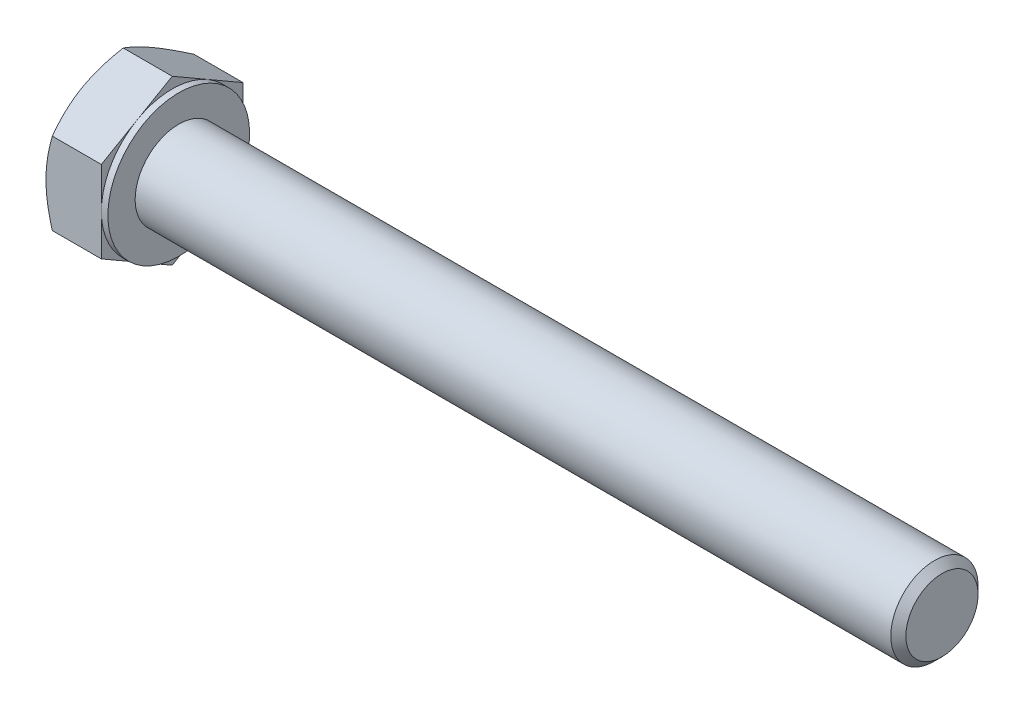
ISO-10303-21;
HEADER;
FILE_DESCRIPTION(('STEP AP214'),'2;1');
FILE_NAME('part.step','',(''),(''),'','','');
FILE_SCHEMA(('AUTOMOTIVE_DESIGN { 1 0 10303 214 1 1 1 1 }'));
ENDSEC;
DATA;
#1=APPLICATION_CONTEXT('core data for automotive mechanical design processes');
#2=APPLICATION_PROTOCOL_DEFINITION('international standard','automotive_design',2000,#1);
#3=PRODUCT_CONTEXT('',#1,'mechanical');
#4=PRODUCT('Part','Part','',(#3));
#5=PRODUCT_RELATED_PRODUCT_CATEGORY('part','',(#4));
#6=PRODUCT_DEFINITION_FORMATION('','',#4);
#7=PRODUCT_DEFINITION_CONTEXT('part definition',#1,'design');
#8=PRODUCT_DEFINITION('design','',#6,#7);
#9=PRODUCT_DEFINITION_SHAPE('','',#8);
#10=(LENGTH_UNIT() NAMED_UNIT(*) SI_UNIT(.MILLI.,.METRE.));
#11=(NAMED_UNIT(*) PLANE_ANGLE_UNIT() SI_UNIT($,.RADIAN.));
#12=(NAMED_UNIT(*) SI_UNIT($,.STERADIAN.) SOLID_ANGLE_UNIT());
#13=UNCERTAINTY_MEASURE_WITH_UNIT(LENGTH_MEASURE(1.E-05),#10,'distance_accuracy_value','');
#14=(GEOMETRIC_REPRESENTATION_CONTEXT(3) GLOBAL_UNCERTAINTY_ASSIGNED_CONTEXT((#13)) GLOBAL_UNIT_ASSIGNED_CONTEXT((#10,
#11,#12)) REPRESENTATION_CONTEXT('',''));
#15=CARTESIAN_POINT('',(0.,0.,0.));
#16=DIRECTION('',(0.,0.,1.));
#17=DIRECTION('',(1.,0.,0.));
#18=AXIS2_PLACEMENT_3D('',#15,#16,#17);
#19=CARTESIAN_POINT('',(5.675,7.50555349946514,0.));
#20=DIRECTION('',(1.,0.,0.));
#21=DIRECTION('',(0.,0.,-1.));
#22=AXIS2_PLACEMENT_3D('',#19,#20,#21);
#23=PLANE('',#22);
#24=CARTESIAN_POINT('',(5.675,0.,0.));
#25=DIRECTION('',(1.,0.,0.));
#26=DIRECTION('',(0.,0.,-1.));
#27=AXIS2_PLACEMENT_3D('',#24,#25,#26);
#28=CIRCLE('',#27,4.);
#29=CARTESIAN_POINT('',(5.675,0.,-4.));
#30=VERTEX_POINT('',#29);
#31=EDGE_CURVE('E279',#30,#30,#28,.F.);
#32=ORIENTED_EDGE('',*,*,#31,.T.);
#33=EDGE_LOOP('',(#32));
#34=FACE_BOUND('',#33,.T.);
#35=CARTESIAN_POINT('',(5.675,0.,0.));
#36=DIRECTION('',(1.,0.,0.));
#37=DIRECTION('',(0.,0.,-1.));
#38=AXIS2_PLACEMENT_3D('',#35,#36,#37);
#39=CIRCLE('',#38,6.5);
#40=CARTESIAN_POINT('',(5.675,0.,-6.5));
#41=VERTEX_POINT('',#40);
#42=EDGE_CURVE('E298',#41,#41,#39,.T.);
#43=ORIENTED_EDGE('',*,*,#42,.T.);
#44=EDGE_LOOP('',(#43));
#45=FACE_BOUND('',#44,.T.);
#46=ADVANCED_FACE('F35',(#34,#45),#23,.T.);
#47=CARTESIAN_POINT('',(0.,0.,0.));
#48=DIRECTION('',(-1.,0.,0.));
#49=DIRECTION('',(0.,0.,1.));
#50=AXIS2_PLACEMENT_3D('',#47,#48,#49);
#51=CYLINDRICAL_SURFACE('',#50,4.);
#52=ORIENTED_EDGE('',*,*,#31,.F.);
#53=EDGE_LOOP('',(#52));
#54=FACE_BOUND('',#53,.T.);
#55=CARTESIAN_POINT('',(74.9845,0.,0.));
#56=DIRECTION('',(-1.,0.,0.));
#57=DIRECTION('',(0.,0.,1.));
#58=AXIS2_PLACEMENT_3D('',#55,#56,#57);
#59=CIRCLE('',#58,4.);
#60=CARTESIAN_POINT('',(74.9845,0.,4.));
#61=VERTEX_POINT('',#60);
#62=EDGE_CURVE('E276',#61,#61,#59,.T.);
#63=ORIENTED_EDGE('',*,*,#62,.T.);
#64=EDGE_LOOP('',(#63));
#65=FACE_BOUND('',#64,.T.);
#66=ADVANCED_FACE('F250',(#54,#65),#51,.T.);
#67=CARTESIAN_POINT('',(75.675,0.,0.));
#68=DIRECTION('',(-1.,0.,0.));
#69=DIRECTION('',(0.,0.,1.));
#70=AXIS2_PLACEMENT_3D('',#67,#68,#69);
#71=CONICAL_SURFACE('',#70,3.3095,0.785398163397411);
#72=ORIENTED_EDGE('',*,*,#62,.F.);
#73=EDGE_LOOP('',(#72));
#74=FACE_BOUND('',#73,.T.);
#75=CARTESIAN_POINT('',(75.675,0.,0.));
#76=DIRECTION('',(-1.,0.,0.));
#77=DIRECTION('',(0.,0.,1.));
#78=AXIS2_PLACEMENT_3D('',#75,#76,#77);
#79=CIRCLE('',#78,3.3095);
#80=CARTESIAN_POINT('',(75.675,0.,3.3095));
#81=VERTEX_POINT('',#80);
#82=EDGE_CURVE('E274',#81,#81,#79,.T.);
#83=ORIENTED_EDGE('',*,*,#82,.T.);
#84=EDGE_LOOP('',(#83));
#85=FACE_BOUND('',#84,.T.);
#86=ADVANCED_FACE('F255',(#74,#85),#71,.T.);
#87=CARTESIAN_POINT('',(75.675,0.,0.));
#88=DIRECTION('',(-1.,0.,0.));
#89=DIRECTION('',(0.,0.,1.));
#90=AXIS2_PLACEMENT_3D('',#87,#88,#89);
#91=PLANE('',#90);
#92=ORIENTED_EDGE('',*,*,#82,.F.);
#93=EDGE_LOOP('',(#92));
#94=FACE_BOUND('',#93,.T.);
#95=ADVANCED_FACE('F262',(#94),#91,.F.);
#96=CARTESIAN_POINT('',(5.075,6.5,0.));
#97=DIRECTION('',(1.,0.,0.));
#98=DIRECTION('',(0.,0.,-1.));
#99=AXIS2_PLACEMENT_3D('',#96,#97,#98);
#100=PLANE('',#99);
#101=DIRECTION('',(0.,0.500000000000001,0.866025403784438));
#102=VECTOR('',#101,1.);
#103=CARTESIAN_POINT('',(5.075,3.75277674973256,-6.5));
#104=LINE('',#103,#102);
#105=CARTESIAN_POINT('',(5.075,3.75277674973256,-6.5));
#106=VERTEX_POINT('',#105);
#107=CARTESIAN_POINT('',(5.075,5.62916512459885,-3.25000000000001));
#108=VERTEX_POINT('',#107);
#109=EDGE_CURVE('E168',#106,#108,#104,.T.);
#110=ORIENTED_EDGE('',*,*,#109,.T.);
#111=CARTESIAN_POINT('',(5.075,0.,0.));
#112=DIRECTION('',(-1.,0.,0.));
#113=DIRECTION('',(0.,0.,1.));
#114=AXIS2_PLACEMENT_3D('',#111,#112,#113);
#115=CIRCLE('',#114,6.5);
#116=CARTESIAN_POINT('',(5.075,0.,-6.5));
#117=VERTEX_POINT('',#116);
#118=EDGE_CURVE('E51',#108,#117,#115,.T.);
#119=ORIENTED_EDGE('',*,*,#118,.T.);
#120=DIRECTION('',(0.,1.,0.));
#121=VECTOR('',#120,1.);
#122=CARTESIAN_POINT('',(5.075,3.75277674973256,-6.5));
#123=LINE('',#122,#121);
#124=EDGE_CURVE('E40',#117,#106,#123,.T.);
#125=ORIENTED_EDGE('',*,*,#124,.T.);
#126=EDGE_LOOP('',(#110,#119,#125));
#127=FACE_BOUND('',#126,.T.);
#128=ADVANCED_FACE('F265',(#127),#100,.T.);
#129=CARTESIAN_POINT('',(5.075,7.50555349946514,0.));
#130=VERTEX_POINT('',#129);
#131=EDGE_CURVE('E166',#108,#130,#104,.T.);
#132=ORIENTED_EDGE('',*,*,#131,.T.);
#133=DIRECTION('',(0.,-0.500000000000001,0.866025403784438));
#134=VECTOR('',#133,1.);
#135=CARTESIAN_POINT('',(5.075,7.50555349946514,0.));
#136=LINE('',#135,#134);
#137=CARTESIAN_POINT('',(5.075,5.62916512459885,3.25000000000001));
#138=VERTEX_POINT('',#137);
#139=EDGE_CURVE('E165',#130,#138,#136,.T.);
#140=ORIENTED_EDGE('',*,*,#139,.T.);
#141=EDGE_CURVE('E154',#138,#108,#115,.T.);
#142=ORIENTED_EDGE('',*,*,#141,.T.);
#143=EDGE_LOOP('',(#132,#140,#142));
#144=FACE_BOUND('',#143,.T.);
#145=ADVANCED_FACE('F270',(#144),#100,.T.);
#146=CARTESIAN_POINT('',(5.075,3.75277674973256,6.5));
#147=VERTEX_POINT('',#146);
#148=EDGE_CURVE('E133',#138,#147,#136,.T.);
#149=ORIENTED_EDGE('',*,*,#148,.T.);
#150=DIRECTION('',(0.,-1.,0.));
#151=VECTOR('',#150,1.);
#152=CARTESIAN_POINT('',(5.075,3.75277674973256,6.5));
#153=LINE('',#152,#151);
#154=CARTESIAN_POINT('',(5.075,0.,6.5));
#155=VERTEX_POINT('',#154);
#156=EDGE_CURVE('E127',#147,#155,#153,.T.);
#157=ORIENTED_EDGE('',*,*,#156,.T.);
#158=EDGE_CURVE('E131',#155,#138,#115,.T.);
#159=ORIENTED_EDGE('',*,*,#158,.T.);
#160=EDGE_LOOP('',(#149,#157,#159));
#161=FACE_BOUND('',#160,.T.);
#162=ADVANCED_FACE('F129',(#161),#100,.T.);
#163=CARTESIAN_POINT('',(5.075,-3.75277674973257,6.5));
#164=VERTEX_POINT('',#163);
#165=EDGE_CURVE('E137',#155,#164,#153,.T.);
#166=ORIENTED_EDGE('',*,*,#165,.T.);
#167=DIRECTION('',(0.,-0.500000000000001,-0.866025403784438));
#168=VECTOR('',#167,1.);
#169=CARTESIAN_POINT('',(5.075,-7.50555349946515,0.));
#170=LINE('',#169,#168);
#171=CARTESIAN_POINT('',(5.075,-5.62916512459885,3.25000000000001));
#172=VERTEX_POINT('',#171);
#173=EDGE_CURVE('E144',#164,#172,#170,.T.);
#174=ORIENTED_EDGE('',*,*,#173,.T.);
#175=EDGE_CURVE('E141',#172,#155,#115,.T.);
#176=ORIENTED_EDGE('',*,*,#175,.T.);
#177=EDGE_LOOP('',(#166,#174,#176));
#178=FACE_BOUND('',#177,.T.);
#179=ADVANCED_FACE('F142',(#178),#100,.T.);
#180=CARTESIAN_POINT('',(5.075,-7.50555349946515,0.));
#181=VERTEX_POINT('',#180);
#182=EDGE_CURVE('E160',#172,#181,#170,.T.);
#183=ORIENTED_EDGE('',*,*,#182,.T.);
#184=DIRECTION('',(0.,0.500000000000001,-0.866025403784438));
#185=VECTOR('',#184,1.);
#186=CARTESIAN_POINT('',(5.075,-3.75277674973258,-6.5));
#187=LINE('',#186,#185);
#188=CARTESIAN_POINT('',(5.075,-5.62916512459885,-3.25000000000001));
#189=VERTEX_POINT('',#188);
#190=EDGE_CURVE('E334',#181,#189,#187,.T.);
#191=ORIENTED_EDGE('',*,*,#190,.T.);
#192=EDGE_CURVE('E148',#189,#172,#115,.T.);
#193=ORIENTED_EDGE('',*,*,#192,.T.);
#194=EDGE_LOOP('',(#183,#191,#193));
#195=FACE_BOUND('',#194,.T.);
#196=ADVANCED_FACE('F339',(#195),#100,.T.);
#197=CARTESIAN_POINT('',(5.075,-3.75277674973258,-6.5));
#198=VERTEX_POINT('',#197);
#199=EDGE_CURVE('E155',#189,#198,#187,.T.);
#200=ORIENTED_EDGE('',*,*,#199,.T.);
#201=EDGE_CURVE('E11',#198,#117,#123,.T.);
#202=ORIENTED_EDGE('',*,*,#201,.T.);
#203=EDGE_CURVE('E352',#117,#189,#115,.T.);
#204=ORIENTED_EDGE('',*,*,#203,.T.);
#205=EDGE_LOOP('',(#200,#202,#204));
#206=FACE_BOUND('',#205,.T.);
#207=ADVANCED_FACE('F271',(#206),#100,.T.);
#208=CARTESIAN_POINT('',(0.,0.,0.));
#209=DIRECTION('',(-1.,0.,0.));
#210=DIRECTION('',(0.,0.,1.));
#211=AXIS2_PLACEMENT_3D('',#208,#209,#210);
#212=CYLINDRICAL_SURFACE('',#211,6.5);
#213=ORIENTED_EDGE('',*,*,#118,.F.);
#214=ORIENTED_EDGE('',*,*,#141,.F.);
#215=ORIENTED_EDGE('',*,*,#158,.F.);
#216=ORIENTED_EDGE('',*,*,#175,.F.);
#217=ORIENTED_EDGE('',*,*,#192,.F.);
#218=ORIENTED_EDGE('',*,*,#203,.F.);
#219=EDGE_LOOP('',(#213,#214,#215,#216,#217,#218));
#220=FACE_BOUND('',#219,.T.);
#221=ORIENTED_EDGE('',*,*,#42,.F.);
#222=EDGE_LOOP('',(#221));
#223=FACE_BOUND('',#222,.T.);
#224=ADVANCED_FACE('F151',(#220,#223),#212,.T.);
#225=CARTESIAN_POINT('',(0.,7.50555349946514,0.));
#226=DIRECTION('',(1.,0.,0.));
#227=DIRECTION('',(0.,0.,-1.));
#228=AXIS2_PLACEMENT_3D('',#225,#226,#227);
#229=PLANE('',#228);
#230=CARTESIAN_POINT('',(0.,0.,0.));
#231=DIRECTION('',(1.,0.,0.));
#232=DIRECTION('',(0.,0.,-1.));
#233=AXIS2_PLACEMENT_3D('',#230,#231,#232);
#234=CIRCLE('',#233,6.5);
#235=CARTESIAN_POINT('',(0.,0.,-6.5));
#236=VERTEX_POINT('',#235);
#237=CARTESIAN_POINT('',(0.,5.62916512459885,-3.25000000000001));
#238=VERTEX_POINT('',#237);
#239=EDGE_CURVE('E297',#236,#238,#234,.T.);
#240=ORIENTED_EDGE('',*,*,#239,.F.);
#241=CARTESIAN_POINT('',(0.,-5.62916512459885,-3.25000000000001));
#242=VERTEX_POINT('',#241);
#243=EDGE_CURVE('E294',#242,#236,#234,.T.);
#244=ORIENTED_EDGE('',*,*,#243,.F.);
#245=CARTESIAN_POINT('',(0.,-5.62916512459885,3.25000000000001));
#246=VERTEX_POINT('',#245);
#247=EDGE_CURVE('E296',#246,#242,#234,.T.);
#248=ORIENTED_EDGE('',*,*,#247,.F.);
#249=CARTESIAN_POINT('',(0.,0.,6.5));
#250=VERTEX_POINT('',#249);
#251=EDGE_CURVE('E306',#250,#246,#234,.T.);
#252=ORIENTED_EDGE('',*,*,#251,.F.);
#253=CARTESIAN_POINT('',(0.,0.,0.));
#254=DIRECTION('',(-1.,0.,0.));
#255=DIRECTION('',(0.,0.,1.));
#256=AXIS2_PLACEMENT_3D('',#253,#254,#255);
#257=CIRCLE('',#256,6.5);
#258=CARTESIAN_POINT('',(0.,5.62916512459885,3.25000000000001));
#259=VERTEX_POINT('',#258);
#260=EDGE_CURVE('E169',#250,#259,#257,.T.);
#261=ORIENTED_EDGE('',*,*,#260,.T.);
#262=EDGE_CURVE('E301',#238,#259,#234,.T.);
#263=ORIENTED_EDGE('',*,*,#262,.F.);
#264=EDGE_LOOP('',(#240,#244,#248,#252,#261,#263));
#265=FACE_BOUND('',#264,.T.);
#266=ADVANCED_FACE('F200',(#265),#229,.F.);
#267=CARTESIAN_POINT('',(0.,0.,0.));
#268=DIRECTION('',(1.,0.,0.));
#269=DIRECTION('',(0.,0.,-1.));
#270=AXIS2_PLACEMENT_3D('',#267,#268,#269);
#271=CONICAL_SURFACE('',#270,6.5,1.0471975511966);
#272=CARTESIAN_POINT('',(0.580623251805865,3.75266127967873,6.5002));
#273=CARTESIAN_POINT('',(0.533004423075483,3.8351516191275,6.35732254094112));
#274=CARTESIAN_POINT('',(0.487546700602704,3.91794952254312,6.21391236546509));
#275=CARTESIAN_POINT('',(0.401548682023044,4.08421773795794,5.9259273686828));
#276=CARTESIAN_POINT('',(0.361010507228023,4.16768832359105,5.78135207342873));
#277=CARTESIAN_POINT('',(0.247571001123207,4.41943655294051,5.34531134947996));
#278=CARTESIAN_POINT('',(0.183047807128738,4.58870793403689,5.05212471715368));
#279=CARTESIAN_POINT('',(0.107386583547491,4.84201947708215,4.61337625445563));
#280=CARTESIAN_POINT('',(0.0858328564569869,4.92530276780316,4.46912536350531));
#281=CARTESIAN_POINT('',(0.0496903146061184,5.09224566542477,4.17997178286191));
#282=CARTESIAN_POINT('',(0.0351008844596658,5.17590523841627,4.03506915190111));
#283=CARTESIAN_POINT('',(0.0132587525073462,5.34336968579964,3.74501222057168));
#284=CARTESIAN_POINT('',(0.0059977243221076,5.427174286676,3.59985839394579));
#285=CARTESIAN_POINT('',(-0.00103969741776859,5.59485627940483,3.30942466302505));
#286=CARTESIAN_POINT('',(-0.000816322187795488,5.6787336689286,3.16414476276364));
#287=CARTESIAN_POINT('',(0.010083458515165,5.90853103021317,2.76612405757351));
#288=CARTESIAN_POINT('',(0.0283818178694134,6.05437578112763,2.51351353897243));
#289=CARTESIAN_POINT('',(0.0864063414576754,6.34509659313135,2.00997032176432));
#290=CARTESIAN_POINT('',(0.126152338538245,6.48997163178545,1.75903939406692));
#291=CARTESIAN_POINT('',(0.22550590320215,6.78127752911039,1.25448277935568));
#292=CARTESIAN_POINT('',(0.285534425638028,6.92767163007068,1.00092075856409));
#293=CARTESIAN_POINT('',(0.42177499250987,7.21827667013277,0.497578064240955));
#294=CARTESIAN_POINT('',(0.497955034163595,7.36249133098589,0.247790944447036));
#295=CARTESIAN_POINT('',(0.580623251805869,7.50566896951898,-0.000200000000000203));
#296=B_SPLINE_CURVE_WITH_KNOTS('',3,(#272,#273,#274,#275,#276,#277,#278,#279,#280,#281,#282,
#283,#284,#285,#286,#287,#288,#289,#290,#291,#292,#293,#294,#295),.UNSPECIFIED.,.F.,.F.,(4,2,2,
2,2,2,2,2,2,2,2,4),(0.,0.515105052395588,1.03043143507524,2.06322554824262,2.56697389547996,
3.07067772176454,3.57380860368928,4.0769239424252,4.9527935470566,5.82947446853466,
6.72559912449736,7.61996451221046),.UNSPECIFIED.);
#297=CARTESIAN_POINT('',(0.580556583600765,7.50555349946514,0.));
#298=VERTEX_POINT('',#297);
#299=EDGE_CURVE('E219',#259,#298,#296,.T.);
#300=ORIENTED_EDGE('',*,*,#299,.T.);
#301=CARTESIAN_POINT('',(0.580623251805869,7.50566896951898,0.0002));
#302=CARTESIAN_POINT('',(0.533004423075487,7.4231786300702,-0.14267745905888));
#303=CARTESIAN_POINT('',(0.487546700602708,7.34038072665458,-0.286087634534913));
#304=CARTESIAN_POINT('',(0.401548682023047,7.17411251123976,-0.574072631317195));
#305=CARTESIAN_POINT('',(0.361010507228027,7.09064192560665,-0.718647926571264));
#306=CARTESIAN_POINT('',(0.24757100112321,6.83889369625719,-1.15468865052003));
#307=CARTESIAN_POINT('',(0.183047807128741,6.66962231516081,-1.44787528284632));
#308=CARTESIAN_POINT('',(0.107386583547493,6.41631077211555,-1.88662374554437));
#309=CARTESIAN_POINT('',(0.0858328564569883,6.33302748139454,-2.03087463649469));
#310=CARTESIAN_POINT('',(0.0496903146061195,6.16608458377293,-2.32002821713809));
#311=CARTESIAN_POINT('',(0.035100884459667,6.08242501078143,-2.46493084809889));
#312=CARTESIAN_POINT('',(0.013258752507347,5.91496056339806,-2.75498777942832));
#313=CARTESIAN_POINT('',(0.00599772432210792,5.8311559625217,-2.90014160605421));
#314=CARTESIAN_POINT('',(-0.00103969741776867,5.66347396979287,-3.19057533697495));
#315=CARTESIAN_POINT('',(-0.000816322187795479,5.5795965802691,-3.33585523723636));
#316=CARTESIAN_POINT('',(0.010083458515165,5.34979921898453,-3.73387594242649));
#317=CARTESIAN_POINT('',(0.028381817869413,5.20395446807007,-3.98648646102757));
#318=CARTESIAN_POINT('',(0.0864063414576743,4.91323365606635,-4.49002967823568));
#319=CARTESIAN_POINT('',(0.126152338538243,4.76835861741226,-4.74096060593308));
#320=CARTESIAN_POINT('',(0.225505903202148,4.47705272008731,-5.24551722064432));
#321=CARTESIAN_POINT('',(0.285534425638025,4.33065861912702,-5.49907924143591));
#322=CARTESIAN_POINT('',(0.421774992509866,4.04005357906493,-6.00242193575904));
#323=CARTESIAN_POINT('',(0.497955034163591,3.89583891821181,-6.25220905555296));
#324=CARTESIAN_POINT('',(0.580623251805865,3.75266127967873,-6.5002));
#325=B_SPLINE_CURVE_WITH_KNOTS('',3,(#301,#302,#303,#304,#305,#306,#307,#308,#309,#310,#311,
#312,#313,#314,#315,#316,#317,#318,#319,#320,#321,#322,#323,#324),.UNSPECIFIED.,.F.,.F.,(4,2,2,
2,2,2,2,2,2,2,2,4),(0.,0.515105052395588,1.03043143507525,2.06322554824262,2.56697389547997,
3.07067772176454,3.57380860368928,4.0769239424252,4.9527935470566,5.82947446853467,
6.72559912449737,7.61996451221046),.UNSPECIFIED.);
#326=EDGE_CURVE('E59',#298,#238,#325,.T.);
#327=ORIENTED_EDGE('',*,*,#326,.T.);
#328=ORIENTED_EDGE('',*,*,#262,.T.);
#329=EDGE_LOOP('',(#300,#327,#328));
#330=FACE_BOUND('',#329,.T.);
#331=ADVANCED_FACE('F348',(#330),#271,.T.);
#332=CARTESIAN_POINT('',(3.18835311590246,-10.1137456678934,6.5));
#333=CARTESIAN_POINT('',(3.05034774010468,-9.82952666322138,6.5));
#334=CARTESIAN_POINT('',(2.91365616489938,-9.54465869649274,6.5));
#335=CARTESIAN_POINT('',(2.64363899497541,-8.97327978057921,6.5));
#336=CARTESIAN_POINT('',(2.51031392459097,-8.68676858388472,6.5));
#337=CARTESIAN_POINT('',(2.24710473482719,-8.11029837842688,6.5));
#338=CARTESIAN_POINT('',(2.1172430043868,-7.82032911201511,6.5));
#339=CARTESIAN_POINT('',(1.86279082826903,-7.23809541022339,6.5));
#340=CARTESIAN_POINT('',(1.73820013554674,-6.94583108317207,6.5));
#341=CARTESIAN_POINT('',(1.49176685426961,-6.34906440963036,6.5));
#342=CARTESIAN_POINT('',(1.37014257641265,-6.04447142288872,6.5));
#343=CARTESIAN_POINT('',(1.13601865758149,-5.43173420957315,6.5));
#344=CARTESIAN_POINT('',(1.02352003558022,-5.12358959079846,6.5));
#345=CARTESIAN_POINT('',(0.810575368239917,-4.5038256978226,6.5));
#346=CARTESIAN_POINT('',(0.710105232302005,-4.19221478266993,6.5));
#347=CARTESIAN_POINT('',(0.524420166144454,-3.56452019206012,6.5));
#348=CARTESIAN_POINT('',(0.439200468206418,-3.24843794792921,6.5));
#349=CARTESIAN_POINT('',(0.288524223401197,-2.61335465712783,6.5));
#350=CARTESIAN_POINT('',(0.222961865744748,-2.29437912059505,6.5));
#351=CARTESIAN_POINT('',(0.115312883130725,-1.65238219405862,6.5));
#352=CARTESIAN_POINT('',(0.0732239014690631,-1.3293612135443,6.5));
#353=CARTESIAN_POINT('',(0.0304887136381663,-0.845231171839984,6.5));
#354=CARTESIAN_POINT('',(0.0196493434273842,-0.684982209663101,6.5));
#355=CARTESIAN_POINT('',(0.00475298486143994,-0.364162349065458,6.5));
#356=CARTESIAN_POINT('',(0.000695882908832085,-0.203591456081877,6.5));
#357=CARTESIAN_POINT('',(-0.000531597190095041,0.117577430374299,6.5));
#358=CARTESIAN_POINT('',(0.00229809017012691,0.278175424090145,6.5));
#359=CARTESIAN_POINT('',(0.0147726845547639,0.599108972823507,6.5));
#360=CARTESIAN_POINT('',(0.0244179260500518,0.759444514574219,6.5));
#361=CARTESIAN_POINT('',(0.0554961939343001,1.14369946602534,6.5));
#362=CARTESIAN_POINT('',(0.0801030490514518,1.36736763045086,6.5));
#363=CARTESIAN_POINT('',(0.141246537453378,1.81305591311688,6.5));
#364=CARTESIAN_POINT('',(0.177784759614452,2.03507580783109,6.5));
#365=CARTESIAN_POINT('',(0.303360001332116,2.69839633433796,6.5));
#366=CARTESIAN_POINT('',(0.408335815147596,3.13672010374357,6.5));
#367=CARTESIAN_POINT('',(0.590564593134941,3.79232112918118,6.5));
#368=CARTESIAN_POINT('',(0.656313198979092,4.01299150874073,6.5));
#369=CARTESIAN_POINT('',(0.794681634200732,4.45218859008391,6.5));
#370=CARTESIAN_POINT('',(0.867301513122618,4.67071527639819,6.5));
#371=CARTESIAN_POINT('',(1.01824353854295,5.10569490252726,6.5));
#372=CARTESIAN_POINT('',(1.09656388232839,5.32214847365076,6.5));
#373=CARTESIAN_POINT('',(1.25798086164821,5.75325725773039,6.5));
#374=CARTESIAN_POINT('',(1.34107741035995,5.96791250329556,6.5));
#375=CARTESIAN_POINT('',(1.56029019583041,6.51888445936372,6.5));
#376=CARTESIAN_POINT('',(1.69936356666534,6.85402316813627,6.5));
#377=CARTESIAN_POINT('',(1.98501958087353,7.52109583939393,6.5));
#378=CARTESIAN_POINT('',(2.13160288780791,7.85302951559933,6.5));
#379=CARTESIAN_POINT('',(2.43059748044951,8.51437865518658,6.5));
#380=CARTESIAN_POINT('',(2.58301057596959,8.84379329784094,6.5));
#381=CARTESIAN_POINT('',(2.89234869374927,9.50047798683784,6.5));
#382=CARTESIAN_POINT('',(3.04927357220059,9.82774810112757,6.5));
#383=CARTESIAN_POINT('',(3.36692013130636,10.4809971975748,6.5));
#384=CARTESIAN_POINT('',(3.52764676491733,10.8069737667408,6.5));
#385=CARTESIAN_POINT('',(3.85198555554899,11.4574882901034,6.5));
#386=CARTESIAN_POINT('',(4.01559773123066,11.7820262349792,6.5));
#387=CARTESIAN_POINT('',(4.50986185003774,12.7537468114441,6.5));
#388=CARTESIAN_POINT('',(4.84399997978541,13.3991555932469,6.5));
#389=CARTESIAN_POINT('',(5.4857599026592,14.6239779290894,6.5));
#390=CARTESIAN_POINT('',(5.79279643372279,15.2036995760604,6.5));
#391=CARTESIAN_POINT('',(6.4106918822763,16.3611382637875,6.5));
#392=CARTESIAN_POINT('',(6.72155099010109,16.938855202873,6.5));
#393=CARTESIAN_POINT('',(7.34519775439015,18.0910273555999,6.5));
#394=CARTESIAN_POINT('',(7.65797694168864,18.665487160613,6.5));
#395=CARTESIAN_POINT('',(8.28574397153078,19.8131486204439,6.5));
#396=CARTESIAN_POINT('',(8.60073166294279,20.3863503578957,6.5));
#397=CARTESIAN_POINT('',(8.91652967168741,20.9591024521449,6.5));
#398=B_SPLINE_CURVE_WITH_KNOTS('',3,(#332,#333,#334,#335,#336,#337,#338,#339,#340,#341,#342,
#343,#344,#345,#346,#347,#348,#349,#350,#351,#352,#353,#354,#355,#356,#357,#358,#359,#360,#361,
#362,#363,#364,#365,#366,#367,#368,#369,#370,#371,#372,#373,#374,#375,#376,#377,#378,#379,#380,
#381,#382,#383,#384,#385,#386,#387,#388,#389,#390,#391,#392,#393,#394,#395,#396,#397),
.UNSPECIFIED.,.F.,.F.,(4,2,2,2,2,2,2,2,2,2,2,2,2,2,2,2,2,2,2,2,2,2,2,2,2,2,2,2,2,2,2,2,4),(0.,
0.947868666702312,1.89588406483492,2.84900320930536,3.80207763304315,4.78589774082711,
5.76982755141752,6.75175256246685,7.73337005764394,8.70960474890991,9.68574140951124,
10.1674651053568,10.6491807326436,11.1309009419855,11.6126447932157,12.287317572382,
12.9620802330384,14.312318438093,15.0030310344276,15.6937486114326,16.3842486973571,
17.0747362352244,18.1631508683747,19.2516618378194,20.3405135142583,21.4293305231019,
22.5196540547637,23.6099846401957,25.7902468235017,27.7582608872418,29.7263733429304,
31.6886408595598,33.6507753806319),.UNSPECIFIED.);
#399=CARTESIAN_POINT('',(0.580556583600761,3.75277674973256,6.5));
#400=VERTEX_POINT('',#399);
#401=EDGE_CURVE('E233',#250,#400,#398,.T.);
#402=ORIENTED_EDGE('',*,*,#401,.T.);
#403=EDGE_CURVE('E232',#400,#259,#296,.T.);
#404=ORIENTED_EDGE('',*,*,#403,.T.);
#405=ORIENTED_EDGE('',*,*,#260,.F.);
#406=EDGE_LOOP('',(#402,#404,#405));
#407=FACE_BOUND('',#406,.T.);
#408=ADVANCED_FACE('F344',(#407),#271,.T.);
#409=CARTESIAN_POINT('',(0.580556583600764,-3.75277674973257,6.5));
#410=VERTEX_POINT('',#409);
#411=EDGE_CURVE('E277',#410,#250,#398,.T.);
#412=ORIENTED_EDGE('',*,*,#411,.T.);
#413=ORIENTED_EDGE('',*,*,#251,.T.);
#414=CARTESIAN_POINT('',(0.580623251805877,-7.50566896951899,-0.000200000000000017));
#415=CARTESIAN_POINT('',(0.533004423075495,-7.42317863007021,0.14267745905888));
#416=CARTESIAN_POINT('',(0.487546700602715,-7.34038072665459,0.286087634534913));
#417=CARTESIAN_POINT('',(0.401548682023054,-7.17411251123977,0.574072631317196));
#418=CARTESIAN_POINT('',(0.361010507228033,-7.09064192560666,0.718647926571266));
#419=CARTESIAN_POINT('',(0.247571001123216,-6.8388936962572,1.15468865052004));
#420=CARTESIAN_POINT('',(0.183047807128747,-6.66962231516082,1.44787528284632));
#421=CARTESIAN_POINT('',(0.107386583547498,-6.41631077211556,1.88662374554438));
#422=CARTESIAN_POINT('',(0.085832856456994,-6.33302748139455,2.03087463649469));
#423=CARTESIAN_POINT('',(0.0496903146061256,-6.16608458377294,2.32002821713809));
#424=CARTESIAN_POINT('',(0.0351008844596734,-6.08242501078144,2.46493084809889));
#425=CARTESIAN_POINT('',(0.0132587525073533,-5.91496056339808,2.75498777942832));
#426=CARTESIAN_POINT('',(0.0059977243221138,-5.83115596252171,2.90014160605421));
#427=CARTESIAN_POINT('',(-0.00103969741776302,-5.66347396979288,3.19057533697495));
#428=CARTESIAN_POINT('',(-0.000816322187789635,-5.57959658026911,3.33585523723636));
#429=CARTESIAN_POINT('',(0.0100834585151709,-5.34979921898454,3.7338759424265));
#430=CARTESIAN_POINT('',(0.0283818178694184,-5.20395446807008,3.98648646102757));
#431=CARTESIAN_POINT('',(0.0864063414576794,-4.91323365606636,4.49002967823568));
#432=CARTESIAN_POINT('',(0.126152338538249,-4.76835861741226,4.74096060593309));
#433=CARTESIAN_POINT('',(0.225505903202153,-4.47705272008732,5.24551722064432));
#434=CARTESIAN_POINT('',(0.285534425638029,-4.33065861912703,5.49907924143592));
#435=CARTESIAN_POINT('',(0.42177499250987,-4.04005357906494,6.00242193575905));
#436=CARTESIAN_POINT('',(0.497955034163595,-3.89583891821182,6.25220905555296));
#437=CARTESIAN_POINT('',(0.580623251805868,-3.75266127967874,6.5002));
#438=B_SPLINE_CURVE_WITH_KNOTS('',3,(#414,#415,#416,#417,#418,#419,#420,#421,#422,#423,#424,
#425,#426,#427,#428,#429,#430,#431,#432,#433,#434,#435,#436,#437),.UNSPECIFIED.,.F.,.F.,(4,2,2,
2,2,2,2,2,2,2,2,4),(0.,0.515105052395589,1.03043143507525,2.06322554824263,2.56697389547997,
3.07067772176454,3.57380860368929,4.07692394242521,4.95279354705661,5.82947446853467,
6.72559912449737,7.61996451221046),.UNSPECIFIED.);
#439=EDGE_CURVE('E221',#246,#410,#438,.T.);
#440=ORIENTED_EDGE('',*,*,#439,.T.);
#441=EDGE_LOOP('',(#412,#413,#440));
#442=FACE_BOUND('',#441,.T.);
#443=ADVANCED_FACE('F189',(#442),#271,.T.);
#444=CARTESIAN_POINT('',(0.580556583600772,-7.50555349946515,0.));
#445=VERTEX_POINT('',#444);
#446=EDGE_CURVE('E213',#445,#246,#438,.T.);
#447=ORIENTED_EDGE('',*,*,#446,.T.);
#448=ORIENTED_EDGE('',*,*,#247,.T.);
#449=CARTESIAN_POINT('',(0.580623251805869,-3.75266127967874,-6.5002));
#450=CARTESIAN_POINT('',(0.533004423075488,-3.83515161912751,-6.35732254094112));
#451=CARTESIAN_POINT('',(0.487546700602708,-3.91794952254313,-6.21391236546509));
#452=CARTESIAN_POINT('',(0.401548682023048,-4.08421773795796,-5.9259273686828));
#453=CARTESIAN_POINT('',(0.361010507228027,-4.16768832359106,-5.78135207342874));
#454=CARTESIAN_POINT('',(0.247571001123211,-4.41943655294052,-5.34531134947997));
#455=CARTESIAN_POINT('',(0.183047807128742,-4.58870793403691,-5.05212471715368));
#456=CARTESIAN_POINT('',(0.107386583547495,-4.84201947708216,-4.61337625445563));
#457=CARTESIAN_POINT('',(0.0858328564569915,-4.92530276780317,-4.46912536350531));
#458=CARTESIAN_POINT('',(0.0496903146061235,-5.09224566542478,-4.17997178286191));
#459=CARTESIAN_POINT('',(0.0351008844596713,-5.17590523841629,-4.03506915190111));
#460=CARTESIAN_POINT('',(0.0132587525073522,-5.34336968579965,-3.74501222057168));
#461=CARTESIAN_POINT('',(0.00599772432211361,-5.42717428667601,-3.59985839394579));
#462=CARTESIAN_POINT('',(-0.00103969741776234,-5.59485627940485,-3.30942466302505));
#463=CARTESIAN_POINT('',(-0.000816322187789011,-5.67873366892861,-3.16414476276364));
#464=CARTESIAN_POINT('',(0.0100834585151719,-5.90853103021318,-2.76612405757351));
#465=CARTESIAN_POINT('',(0.0283818178694203,-6.05437578112765,-2.51351353897243));
#466=CARTESIAN_POINT('',(0.0864063414576825,-6.34509659313136,-2.00997032176432));
#467=CARTESIAN_POINT('',(0.126152338538252,-6.48997163178546,-1.75903939406692));
#468=CARTESIAN_POINT('',(0.225505903202157,-6.7812775291104,-1.25448277935568));
#469=CARTESIAN_POINT('',(0.285534425638035,-6.92767163007069,-1.00092075856409));
#470=CARTESIAN_POINT('',(0.421774992509877,-7.21827667013278,-0.497578064240955));
#471=CARTESIAN_POINT('',(0.497955034163601,-7.3624913309859,-0.247790944447036));
#472=CARTESIAN_POINT('',(0.580623251805876,-7.50566896951899,0.000199999999999574));
#473=B_SPLINE_CURVE_WITH_KNOTS('',3,(#449,#450,#451,#452,#453,#454,#455,#456,#457,#458,#459,
#460,#461,#462,#463,#464,#465,#466,#467,#468,#469,#470,#471,#472),.UNSPECIFIED.,.F.,.F.,(4,2,2,
2,2,2,2,2,2,2,2,4),(0.,0.515105052395589,1.03043143507525,2.06322554824262,2.56697389547996,
3.07067772176454,3.57380860368928,4.0769239424252,4.9527935470566,5.82947446853467,
6.72559912449737,7.61996451221046),.UNSPECIFIED.);
#474=EDGE_CURVE('E220',#242,#445,#473,.T.);
#475=ORIENTED_EDGE('',*,*,#474,.T.);
#476=EDGE_LOOP('',(#447,#448,#475));
#477=FACE_BOUND('',#476,.T.);
#478=ADVANCED_FACE('F315',(#477),#271,.T.);
#479=CARTESIAN_POINT('',(0.580556583600761,3.75277674973256,-6.5));
#480=VERTEX_POINT('',#479);
#481=EDGE_CURVE('E222',#238,#480,#325,.T.);
#482=ORIENTED_EDGE('',*,*,#481,.T.);
#483=CARTESIAN_POINT('',(3.18835311590246,-10.1137456678934,-6.5));
#484=CARTESIAN_POINT('',(3.05034774010468,-9.82952666322138,-6.5));
#485=CARTESIAN_POINT('',(2.91365616489938,-9.54465869649274,-6.5));
#486=CARTESIAN_POINT('',(2.64363899497541,-8.97327978057922,-6.5));
#487=CARTESIAN_POINT('',(2.51031392459097,-8.68676858388472,-6.5));
#488=CARTESIAN_POINT('',(2.24710473482719,-8.11029837842689,-6.5));
#489=CARTESIAN_POINT('',(2.1172430043868,-7.82032911201512,-6.5));
#490=CARTESIAN_POINT('',(1.86279082826903,-7.2380954102234,-6.5));
#491=CARTESIAN_POINT('',(1.73820013554674,-6.94583108317207,-6.5));
#492=CARTESIAN_POINT('',(1.49176685426961,-6.34906440963036,-6.5));
#493=CARTESIAN_POINT('',(1.37014257641265,-6.04447142288872,-6.5));
#494=CARTESIAN_POINT('',(1.13601865758149,-5.43173420957316,-6.5));
#495=CARTESIAN_POINT('',(1.02352003558022,-5.12358959079846,-6.5));
#496=CARTESIAN_POINT('',(0.810575368239917,-4.5038256978226,-6.5));
#497=CARTESIAN_POINT('',(0.710105232302005,-4.19221478266993,-6.5));
#498=CARTESIAN_POINT('',(0.524420166144454,-3.56452019206012,-6.5));
#499=CARTESIAN_POINT('',(0.439200468206418,-3.24843794792921,-6.5));
#500=CARTESIAN_POINT('',(0.288524223401198,-2.61335465712783,-6.5));
#501=CARTESIAN_POINT('',(0.222961865744749,-2.29437912059505,-6.5));
#502=CARTESIAN_POINT('',(0.115312883130725,-1.65238219405863,-6.5));
#503=CARTESIAN_POINT('',(0.0732239014690639,-1.3293612135443,-6.5));
#504=CARTESIAN_POINT('',(0.0304887136381667,-0.845231171839985,-6.5));
#505=CARTESIAN_POINT('',(0.0196493434273843,-0.684982209663103,-6.5));
#506=CARTESIAN_POINT('',(0.00475298486143982,-0.36416234906546,-6.5));
#507=CARTESIAN_POINT('',(0.000695882908832049,-0.203591456081879,-6.5));
#508=CARTESIAN_POINT('',(-0.000531597190095004,0.117577430374298,-6.5));
#509=CARTESIAN_POINT('',(0.00229809017012692,0.278175424090144,-6.5));
#510=CARTESIAN_POINT('',(0.0147726845547639,0.599108972823506,-6.5));
#511=CARTESIAN_POINT('',(0.0244179260500518,0.759444514574218,-6.5));
#512=CARTESIAN_POINT('',(0.0554961939343001,1.14369946602534,-6.5));
#513=CARTESIAN_POINT('',(0.0801030490514518,1.36736763045086,-6.5));
#514=CARTESIAN_POINT('',(0.141246537453378,1.81305591311688,-6.5));
#515=CARTESIAN_POINT('',(0.177784759614452,2.03507580783108,-6.5));
#516=CARTESIAN_POINT('',(0.303360001332115,2.69839633433796,-6.5));
#517=CARTESIAN_POINT('',(0.408335815147595,3.13672010374357,-6.5));
#518=CARTESIAN_POINT('',(0.590564593134941,3.79232112918118,-6.5));
#519=CARTESIAN_POINT('',(0.656313198979091,4.01299150874073,-6.5));
#520=CARTESIAN_POINT('',(0.794681634200732,4.45218859008391,-6.5));
#521=CARTESIAN_POINT('',(0.867301513122617,4.67071527639819,-6.5));
#522=CARTESIAN_POINT('',(1.01824353854295,5.10569490252726,-6.5));
#523=CARTESIAN_POINT('',(1.09656388232839,5.32214847365076,-6.5));
#524=CARTESIAN_POINT('',(1.25798086164821,5.75325725773039,-6.5));
#525=CARTESIAN_POINT('',(1.34107741035995,5.96791250329556,-6.5));
#526=CARTESIAN_POINT('',(1.56029019583041,6.51888445936372,-6.5));
#527=CARTESIAN_POINT('',(1.69936356666534,6.85402316813627,-6.5));
#528=CARTESIAN_POINT('',(1.98501958087353,7.52109583939393,-6.5));
#529=CARTESIAN_POINT('',(2.13160288780791,7.85302951559933,-6.5));
#530=CARTESIAN_POINT('',(2.43059748044951,8.51437865518658,-6.5));
#531=CARTESIAN_POINT('',(2.58301057596959,8.84379329784094,-6.5));
#532=CARTESIAN_POINT('',(2.89234869374927,9.50047798683784,-6.5));
#533=CARTESIAN_POINT('',(3.04927357220059,9.82774810112757,-6.5));
#534=CARTESIAN_POINT('',(3.36692013130636,10.4809971975748,-6.5));
#535=CARTESIAN_POINT('',(3.52764676491733,10.8069737667408,-6.5));
#536=CARTESIAN_POINT('',(3.85198555554899,11.4574882901034,-6.5));
#537=CARTESIAN_POINT('',(4.01559773123066,11.7820262349792,-6.5));
#538=CARTESIAN_POINT('',(4.50986185003773,12.7537468114441,-6.5));
#539=CARTESIAN_POINT('',(4.84399997978541,13.3991555932469,-6.5));
#540=CARTESIAN_POINT('',(5.48575990265919,14.6239779290894,-6.5));
#541=CARTESIAN_POINT('',(5.79279643372279,15.2036995760604,-6.5));
#542=CARTESIAN_POINT('',(6.4106918822763,16.3611382637875,-6.5));
#543=CARTESIAN_POINT('',(6.72155099010109,16.938855202873,-6.5));
#544=CARTESIAN_POINT('',(7.34519775439015,18.0910273555999,-6.5));
#545=CARTESIAN_POINT('',(7.65797694168864,18.665487160613,-6.5));
#546=CARTESIAN_POINT('',(8.28574397153079,19.8131486204439,-6.5));
#547=CARTESIAN_POINT('',(8.60073166294279,20.3863503578957,-6.5));
#548=CARTESIAN_POINT('',(8.91652967168742,20.9591024521449,-6.5));
#549=B_SPLINE_CURVE_WITH_KNOTS('',3,(#483,#484,#485,#486,#487,#488,#489,#490,#491,#492,#493,
#494,#495,#496,#497,#498,#499,#500,#501,#502,#503,#504,#505,#506,#507,#508,#509,#510,#511,#512,
#513,#514,#515,#516,#517,#518,#519,#520,#521,#522,#523,#524,#525,#526,#527,#528,#529,#530,#531,
#532,#533,#534,#535,#536,#537,#538,#539,#540,#541,#542,#543,#544,#545,#546,#547,#548),
.UNSPECIFIED.,.F.,.F.,(4,2,2,2,2,2,2,2,2,2,2,2,2,2,2,2,2,2,2,2,2,2,2,2,2,2,2,2,2,2,2,2,4),(0.,
0.947868666702312,1.89588406483492,2.84900320930536,3.80207763304314,4.7858977408271,
5.76982755141752,6.75175256246685,7.73337005764394,8.70960474890991,9.68574140951124,
10.1674651053568,10.6491807326436,11.1309009419855,11.6126447932157,12.287317572382,
12.9620802330384,14.312318438093,15.0030310344276,15.6937486114326,16.3842486973571,
17.0747362352244,18.1631508683747,19.2516618378194,20.3405135142583,21.4293305231019,
22.5196540547637,23.6099846401957,25.7902468235016,27.7582608872418,29.7263733429304,
31.6886408595598,33.6507753806319),.UNSPECIFIED.);
#550=EDGE_CURVE('E181',#480,#236,#549,.F.);
#551=ORIENTED_EDGE('',*,*,#550,.T.);
#552=ORIENTED_EDGE('',*,*,#239,.T.);
#553=EDGE_LOOP('',(#482,#551,#552));
#554=FACE_BOUND('',#553,.T.);
#555=ADVANCED_FACE('F329',(#554),#271,.T.);
#556=CARTESIAN_POINT('',(0.580556583600765,-3.75277674973258,-6.5));
#557=VERTEX_POINT('',#556);
#558=EDGE_CURVE('E182',#557,#242,#473,.T.);
#559=ORIENTED_EDGE('',*,*,#558,.T.);
#560=ORIENTED_EDGE('',*,*,#243,.T.);
#561=EDGE_CURVE('E172',#236,#557,#549,.F.);
#562=ORIENTED_EDGE('',*,*,#561,.T.);
#563=EDGE_LOOP('',(#559,#560,#562));
#564=FACE_BOUND('',#563,.T.);
#565=ADVANCED_FACE('F198',(#564),#271,.T.);
#566=CARTESIAN_POINT('',(5.675,3.75277674973256,-6.5));
#567=DIRECTION('',(0.,0.,1.));
#568=DIRECTION('',(0.,-1.,0.));
#569=AXIS2_PLACEMENT_3D('',#566,#567,#568);
#570=PLANE('',#569);
#571=ORIENTED_EDGE('',*,*,#201,.F.);
#572=DIRECTION('',(-1.,0.,0.));
#573=VECTOR('',#572,1.);
#574=CARTESIAN_POINT('',(5.675,-3.75277674973258,-6.5));
#575=LINE('',#574,#573);
#576=EDGE_CURVE('E285',#198,#557,#575,.T.);
#577=ORIENTED_EDGE('',*,*,#576,.T.);
#578=ORIENTED_EDGE('',*,*,#561,.F.);
#579=ORIENTED_EDGE('',*,*,#550,.F.);
#580=DIRECTION('',(-1.,0.,0.));
#581=VECTOR('',#580,1.);
#582=CARTESIAN_POINT('',(5.675,3.75277674973256,-6.5));
#583=LINE('',#582,#581);
#584=EDGE_CURVE('E283',#106,#480,#583,.T.);
#585=ORIENTED_EDGE('',*,*,#584,.F.);
#586=ORIENTED_EDGE('',*,*,#124,.F.);
#587=EDGE_LOOP('',(#571,#577,#578,#579,#585,#586));
#588=FACE_BOUND('',#587,.T.);
#589=ADVANCED_FACE('F193',(#588),#570,.F.);
#590=CARTESIAN_POINT('',(5.675,-3.75277674973258,-6.5));
#591=DIRECTION('',(0.,0.866025403784438,0.500000000000001));
#592=DIRECTION('',(0.,-0.500000000000001,0.866025403784438));
#593=AXIS2_PLACEMENT_3D('',#590,#591,#592);
#594=PLANE('',#593);
#595=ORIENTED_EDGE('',*,*,#190,.F.);
#596=DIRECTION('',(-1.,0.,0.));
#597=VECTOR('',#596,1.);
#598=CARTESIAN_POINT('',(5.675,-7.50555349946515,0.));
#599=LINE('',#598,#597);
#600=EDGE_CURVE('E287',#181,#445,#599,.T.);
#601=ORIENTED_EDGE('',*,*,#600,.T.);
#602=ORIENTED_EDGE('',*,*,#474,.F.);
#603=ORIENTED_EDGE('',*,*,#558,.F.);
#604=ORIENTED_EDGE('',*,*,#576,.F.);
#605=ORIENTED_EDGE('',*,*,#199,.F.);
#606=EDGE_LOOP('',(#595,#601,#602,#603,#604,#605));
#607=FACE_BOUND('',#606,.T.);
#608=ADVANCED_FACE('F197',(#607),#594,.F.);
#609=CARTESIAN_POINT('',(5.675,-7.50555349946515,0.));
#610=DIRECTION('',(0.,0.866025403784438,-0.500000000000001));
#611=DIRECTION('',(0.,0.500000000000001,0.866025403784438));
#612=AXIS2_PLACEMENT_3D('',#609,#610,#611);
#613=PLANE('',#612);
#614=ORIENTED_EDGE('',*,*,#173,.F.);
#615=DIRECTION('',(-1.,0.,0.));
#616=VECTOR('',#615,1.);
#617=CARTESIAN_POINT('',(5.675,-3.75277674973257,6.5));
#618=LINE('',#617,#616);
#619=EDGE_CURVE('E159',#164,#410,#618,.T.);
#620=ORIENTED_EDGE('',*,*,#619,.T.);
#621=ORIENTED_EDGE('',*,*,#439,.F.);
#622=ORIENTED_EDGE('',*,*,#446,.F.);
#623=ORIENTED_EDGE('',*,*,#600,.F.);
#624=ORIENTED_EDGE('',*,*,#182,.F.);
#625=EDGE_LOOP('',(#614,#620,#621,#622,#623,#624));
#626=FACE_BOUND('',#625,.T.);
#627=ADVANCED_FACE('F205',(#626),#613,.F.);
#628=CARTESIAN_POINT('',(5.675,3.75277674973256,6.5));
#629=DIRECTION('',(0.,0.,-1.));
#630=DIRECTION('',(0.,1.,0.));
#631=AXIS2_PLACEMENT_3D('',#628,#629,#630);
#632=PLANE('',#631);
#633=ORIENTED_EDGE('',*,*,#156,.F.);
#634=DIRECTION('',(-1.,0.,0.));
#635=VECTOR('',#634,1.);
#636=CARTESIAN_POINT('',(5.675,3.75277674973256,6.5));
#637=LINE('',#636,#635);
#638=EDGE_CURVE('E290',#147,#400,#637,.T.);
#639=ORIENTED_EDGE('',*,*,#638,.T.);
#640=ORIENTED_EDGE('',*,*,#401,.F.);
#641=ORIENTED_EDGE('',*,*,#411,.F.);
#642=ORIENTED_EDGE('',*,*,#619,.F.);
#643=ORIENTED_EDGE('',*,*,#165,.F.);
#644=EDGE_LOOP('',(#633,#639,#640,#641,#642,#643));
#645=FACE_BOUND('',#644,.T.);
#646=ADVANCED_FACE('F157',(#645),#632,.F.);
#647=CARTESIAN_POINT('',(5.675,7.50555349946514,0.));
#648=DIRECTION('',(0.,-0.866025403784438,-0.500000000000001));
#649=DIRECTION('',(0.,0.500000000000001,-0.866025403784438));
#650=AXIS2_PLACEMENT_3D('',#647,#648,#649);
#651=PLANE('',#650);
#652=ORIENTED_EDGE('',*,*,#139,.F.);
#653=DIRECTION('',(-1.,0.,0.));
#654=VECTOR('',#653,1.);
#655=CARTESIAN_POINT('',(5.675,7.50555349946514,0.));
#656=LINE('',#655,#654);
#657=EDGE_CURVE('E292',#130,#298,#656,.T.);
#658=ORIENTED_EDGE('',*,*,#657,.T.);
#659=ORIENTED_EDGE('',*,*,#299,.F.);
#660=ORIENTED_EDGE('',*,*,#403,.F.);
#661=ORIENTED_EDGE('',*,*,#638,.F.);
#662=ORIENTED_EDGE('',*,*,#148,.F.);
#663=EDGE_LOOP('',(#652,#658,#659,#660,#661,#662));
#664=FACE_BOUND('',#663,.T.);
#665=ADVANCED_FACE('F239',(#664),#651,.F.);
#666=CARTESIAN_POINT('',(5.675,3.75277674973256,-6.5));
#667=DIRECTION('',(0.,-0.866025403784438,0.500000000000001));
#668=DIRECTION('',(0.,-0.500000000000001,-0.866025403784438));
#669=AXIS2_PLACEMENT_3D('',#666,#667,#668);
#670=PLANE('',#669);
#671=ORIENTED_EDGE('',*,*,#109,.F.);
#672=ORIENTED_EDGE('',*,*,#584,.T.);
#673=ORIENTED_EDGE('',*,*,#481,.F.);
#674=ORIENTED_EDGE('',*,*,#326,.F.);
#675=ORIENTED_EDGE('',*,*,#657,.F.);
#676=ORIENTED_EDGE('',*,*,#131,.F.);
#677=EDGE_LOOP('',(#671,#672,#673,#674,#675,#676));
#678=FACE_BOUND('',#677,.T.);
#679=ADVANCED_FACE('F37',(#678),#670,.F.);
#680=CLOSED_SHELL('',(#46,#66,#86,#95,#128,#145,#162,#179,#196,#207,#224,#266,#331,#408,#443,
#478,#555,#565,#589,#608,#627,#646,#665,#679));
#681=MANIFOLD_SOLID_BREP('B2',#680);
#682=ADVANCED_BREP_SHAPE_REPRESENTATION('',(#18,#681),#14);
#683=SHAPE_DEFINITION_REPRESENTATION(#9,#682);
ENDSEC;
END-ISO-10303-21;
